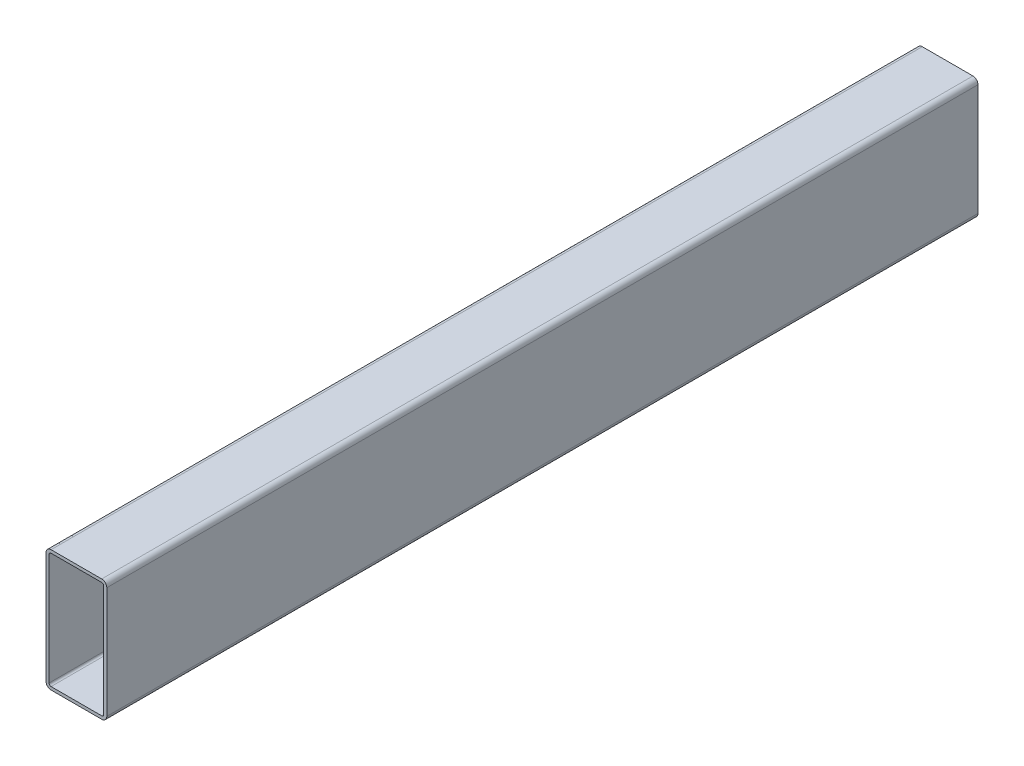
ISO-10303-21;
HEADER;
FILE_DESCRIPTION(('STEP AP214'),'2;1');
FILE_NAME('part.step','',(''),(''),'','','');
FILE_SCHEMA(('AUTOMOTIVE_DESIGN { 1 0 10303 214 1 1 1 1 }'));
ENDSEC;
DATA;
#1=APPLICATION_CONTEXT('core data for automotive mechanical design processes');
#2=APPLICATION_PROTOCOL_DEFINITION('international standard','automotive_design',2000,#1);
#3=PRODUCT_CONTEXT('',#1,'mechanical');
#4=PRODUCT('Part','Part','',(#3));
#5=PRODUCT_RELATED_PRODUCT_CATEGORY('part','',(#4));
#6=PRODUCT_DEFINITION_FORMATION('','',#4);
#7=PRODUCT_DEFINITION_CONTEXT('part definition',#1,'design');
#8=PRODUCT_DEFINITION('design','',#6,#7);
#9=PRODUCT_DEFINITION_SHAPE('','',#8);
#10=(LENGTH_UNIT() NAMED_UNIT(*) SI_UNIT(.MILLI.,.METRE.));
#11=(NAMED_UNIT(*) PLANE_ANGLE_UNIT() SI_UNIT($,.RADIAN.));
#12=(NAMED_UNIT(*) SI_UNIT($,.STERADIAN.) SOLID_ANGLE_UNIT());
#13=UNCERTAINTY_MEASURE_WITH_UNIT(LENGTH_MEASURE(1.E-05),#10,'distance_accuracy_value','');
#14=(GEOMETRIC_REPRESENTATION_CONTEXT(3) GLOBAL_UNCERTAINTY_ASSIGNED_CONTEXT((#13)) GLOBAL_UNIT_ASSIGNED_CONTEXT((#10,
#11,#12)) REPRESENTATION_CONTEXT('',''));
#15=CARTESIAN_POINT('',(0.,0.,0.));
#16=DIRECTION('',(0.,0.,1.));
#17=DIRECTION('',(1.,0.,0.));
#18=AXIS2_PLACEMENT_3D('',#15,#16,#17);
#19=CARTESIAN_POINT('',(-95.,-1299.,-564.164078649986));
#20=DIRECTION('',(0.,0.,1.));
#21=DIRECTION('',(1.,0.,0.));
#22=AXIS2_PLACEMENT_3D('',#19,#20,#21);
#23=CYLINDRICAL_SURFACE('',#22,2.);
#24=CARTESIAN_POINT('',(-95.,-1299.,-429.999999999999));
#25=DIRECTION('',(0.,0.,1.));
#26=DIRECTION('',(1.,0.,0.));
#27=AXIS2_PLACEMENT_3D('',#24,#25,#26);
#28=CIRCLE('',#27,2.);
#29=CARTESIAN_POINT('',(-93.,-1299.,-429.999999999999));
#30=VERTEX_POINT('',#29);
#31=CARTESIAN_POINT('',(-95.,-1297.,-429.999999999999));
#32=VERTEX_POINT('',#31);
#33=EDGE_CURVE('E150',#30,#32,#28,.T.);
#34=ORIENTED_EDGE('',*,*,#33,.F.);
#35=DIRECTION('',(0.,0.,1.));
#36=VECTOR('',#35,1.);
#37=CARTESIAN_POINT('',(-93.,-1299.,-564.164078649986));
#38=LINE('',#37,#36);
#39=CARTESIAN_POINT('',(-93.,-1299.,429.999999999999));
#40=VERTEX_POINT('',#39);
#41=EDGE_CURVE('E142',#40,#30,#38,.F.);
#42=ORIENTED_EDGE('',*,*,#41,.F.);
#43=CARTESIAN_POINT('',(-95.,-1299.,429.999999999999));
#44=DIRECTION('',(0.,0.,1.));
#45=DIRECTION('',(1.,0.,0.));
#46=AXIS2_PLACEMENT_3D('',#43,#44,#45);
#47=CIRCLE('',#46,2.);
#48=CARTESIAN_POINT('',(-95.,-1297.,429.999999999999));
#49=VERTEX_POINT('',#48);
#50=EDGE_CURVE('E204',#40,#49,#47,.T.);
#51=ORIENTED_EDGE('',*,*,#50,.T.);
#52=DIRECTION('',(0.,0.,-1.));
#53=VECTOR('',#52,1.);
#54=CARTESIAN_POINT('',(-95.,-1297.,-564.164078649986));
#55=LINE('',#54,#53);
#56=EDGE_CURVE('E178',#32,#49,#55,.F.);
#57=ORIENTED_EDGE('',*,*,#56,.F.);
#58=EDGE_LOOP('',(#34,#42,#51,#57));
#59=FACE_BOUND('',#58,.T.);
#60=ADVANCED_FACE('F17',(#59),#23,.F.);
#61=CARTESIAN_POINT('',(-150.,-1297.,-564.164078649986));
#62=DIRECTION('',(0.,-1.,0.));
#63=DIRECTION('',(0.,0.,-1.));
#64=AXIS2_PLACEMENT_3D('',#61,#62,#63);
#65=PLANE('',#64);
#66=ORIENTED_EDGE('',*,*,#56,.T.);
#67=DIRECTION('',(-1.,0.,0.));
#68=VECTOR('',#67,1.);
#69=CARTESIAN_POINT('',(1.73275416638304E-05,-1297.,429.999999999999));
#70=LINE('',#69,#68);
#71=CARTESIAN_POINT('',(-145.,-1297.,429.999999999999));
#72=VERTEX_POINT('',#71);
#73=EDGE_CURVE('E203',#49,#72,#70,.T.);
#74=ORIENTED_EDGE('',*,*,#73,.T.);
#75=DIRECTION('',(0.,0.,-1.));
#76=VECTOR('',#75,1.);
#77=CARTESIAN_POINT('',(-145.,-1297.,-564.164078649986));
#78=LINE('',#77,#76);
#79=CARTESIAN_POINT('',(-145.,-1297.,-429.999999999999));
#80=VERTEX_POINT('',#79);
#81=EDGE_CURVE('E176',#72,#80,#78,.T.);
#82=ORIENTED_EDGE('',*,*,#81,.T.);
#83=DIRECTION('',(-1.,0.,0.));
#84=VECTOR('',#83,1.);
#85=CARTESIAN_POINT('',(1.73275416638304E-05,-1297.,-429.999999999999));
#86=LINE('',#85,#84);
#87=EDGE_CURVE('E223',#32,#80,#86,.T.);
#88=ORIENTED_EDGE('',*,*,#87,.F.);
#89=EDGE_LOOP('',(#66,#74,#82,#88));
#90=FACE_BOUND('',#89,.T.);
#91=ADVANCED_FACE('F393',(#90),#65,.T.);
#92=CARTESIAN_POINT('',(-145.,-1299.,-564.164078649986));
#93=DIRECTION('',(0.,0.,-1.));
#94=DIRECTION('',(-1.,0.,0.));
#95=AXIS2_PLACEMENT_3D('',#92,#93,#94);
#96=CYLINDRICAL_SURFACE('',#95,2.);
#97=CARTESIAN_POINT('',(-145.,-1299.,-429.999999999999));
#98=DIRECTION('',(0.,0.,-1.));
#99=DIRECTION('',(-1.,0.,0.));
#100=AXIS2_PLACEMENT_3D('',#97,#98,#99);
#101=CIRCLE('',#100,2.);
#102=CARTESIAN_POINT('',(-147.,-1299.,-429.999999999999));
#103=VERTEX_POINT('',#102);
#104=EDGE_CURVE('E221',#80,#103,#101,.F.);
#105=ORIENTED_EDGE('',*,*,#104,.F.);
#106=ORIENTED_EDGE('',*,*,#81,.F.);
#107=CARTESIAN_POINT('',(-145.,-1299.,429.999999999999));
#108=DIRECTION('',(0.,0.,-1.));
#109=DIRECTION('',(-1.,0.,0.));
#110=AXIS2_PLACEMENT_3D('',#107,#108,#109);
#111=CIRCLE('',#110,2.);
#112=CARTESIAN_POINT('',(-147.,-1299.,429.999999999999));
#113=VERTEX_POINT('',#112);
#114=EDGE_CURVE('E201',#72,#113,#111,.F.);
#115=ORIENTED_EDGE('',*,*,#114,.T.);
#116=DIRECTION('',(0.,0.,1.));
#117=VECTOR('',#116,1.);
#118=CARTESIAN_POINT('',(-147.,-1299.,-564.164078649986));
#119=LINE('',#118,#117);
#120=EDGE_CURVE('E174',#113,#103,#119,.F.);
#121=ORIENTED_EDGE('',*,*,#120,.T.);
#122=EDGE_LOOP('',(#105,#106,#115,#121));
#123=FACE_BOUND('',#122,.T.);
#124=ADVANCED_FACE('F385',(#123),#96,.F.);
#125=CARTESIAN_POINT('',(-147.,-1294.,-564.164078649986));
#126=DIRECTION('',(-1.,0.,0.));
#127=DIRECTION('',(0.,-1.,0.));
#128=AXIS2_PLACEMENT_3D('',#125,#126,#127);
#129=PLANE('',#128);
#130=DIRECTION('',(0.,1.,0.));
#131=VECTOR('',#130,1.);
#132=CARTESIAN_POINT('',(-147.,-1429.,-429.999999999999));
#133=LINE('',#132,#131);
#134=CARTESIAN_POINT('',(-147.,-1409.,-429.999999999999));
#135=VERTEX_POINT('',#134);
#136=EDGE_CURVE('E220',#103,#135,#133,.F.);
#137=ORIENTED_EDGE('',*,*,#136,.F.);
#138=ORIENTED_EDGE('',*,*,#120,.F.);
#139=DIRECTION('',(0.,1.,0.));
#140=VECTOR('',#139,1.);
#141=CARTESIAN_POINT('',(-147.,-1429.,429.999999999999));
#142=LINE('',#141,#140);
#143=CARTESIAN_POINT('',(-147.,-1409.,429.999999999999));
#144=VERTEX_POINT('',#143);
#145=EDGE_CURVE('E200',#113,#144,#142,.F.);
#146=ORIENTED_EDGE('',*,*,#145,.T.);
#147=DIRECTION('',(0.,0.,1.));
#148=VECTOR('',#147,1.);
#149=CARTESIAN_POINT('',(-147.,-1409.,-564.164078649986));
#150=LINE('',#149,#148);
#151=EDGE_CURVE('E172',#144,#135,#150,.F.);
#152=ORIENTED_EDGE('',*,*,#151,.T.);
#153=EDGE_LOOP('',(#137,#138,#146,#152));
#154=FACE_BOUND('',#153,.T.);
#155=ADVANCED_FACE('F377',(#154),#129,.F.);
#156=CARTESIAN_POINT('',(-145.,-1409.,-564.164078649986));
#157=DIRECTION('',(0.,0.,1.));
#158=DIRECTION('',(1.,0.,0.));
#159=AXIS2_PLACEMENT_3D('',#156,#157,#158);
#160=CYLINDRICAL_SURFACE('',#159,2.);
#161=CARTESIAN_POINT('',(-145.,-1409.,-429.999999999999));
#162=DIRECTION('',(0.,0.,1.));
#163=DIRECTION('',(1.,0.,0.));
#164=AXIS2_PLACEMENT_3D('',#161,#162,#163);
#165=CIRCLE('',#164,2.);
#166=CARTESIAN_POINT('',(-145.,-1411.,-429.999999999999));
#167=VERTEX_POINT('',#166);
#168=EDGE_CURVE('E218',#135,#167,#165,.T.);
#169=ORIENTED_EDGE('',*,*,#168,.F.);
#170=ORIENTED_EDGE('',*,*,#151,.F.);
#171=CARTESIAN_POINT('',(-145.,-1409.,429.999999999999));
#172=DIRECTION('',(0.,0.,1.));
#173=DIRECTION('',(1.,0.,0.));
#174=AXIS2_PLACEMENT_3D('',#171,#172,#173);
#175=CIRCLE('',#174,2.);
#176=CARTESIAN_POINT('',(-145.,-1411.,429.999999999999));
#177=VERTEX_POINT('',#176);
#178=EDGE_CURVE('E198',#144,#177,#175,.T.);
#179=ORIENTED_EDGE('',*,*,#178,.T.);
#180=DIRECTION('',(0.,0.,-1.));
#181=VECTOR('',#180,1.);
#182=CARTESIAN_POINT('',(-145.,-1411.,-564.164078649986));
#183=LINE('',#182,#181);
#184=EDGE_CURVE('E170',#177,#167,#183,.T.);
#185=ORIENTED_EDGE('',*,*,#184,.T.);
#186=EDGE_LOOP('',(#169,#170,#179,#185));
#187=FACE_BOUND('',#186,.T.);
#188=ADVANCED_FACE('F370',(#187),#160,.F.);
#189=CARTESIAN_POINT('',(-150.,-1411.,-564.164078649986));
#190=DIRECTION('',(0.,-1.,0.));
#191=DIRECTION('',(0.,0.,-1.));
#192=AXIS2_PLACEMENT_3D('',#189,#190,#191);
#193=PLANE('',#192);
#194=DIRECTION('',(-1.,0.,0.));
#195=VECTOR('',#194,1.);
#196=CARTESIAN_POINT('',(1.73275416638304E-05,-1411.,429.999999999999));
#197=LINE('',#196,#195);
#198=CARTESIAN_POINT('',(-95.,-1411.,429.999999999999));
#199=VERTEX_POINT('',#198);
#200=EDGE_CURVE('E197',#177,#199,#197,.F.);
#201=ORIENTED_EDGE('',*,*,#200,.T.);
#202=DIRECTION('',(0.,0.,-1.));
#203=VECTOR('',#202,1.);
#204=CARTESIAN_POINT('',(-95.,-1411.,-564.164078649986));
#205=LINE('',#204,#203);
#206=CARTESIAN_POINT('',(-95.,-1411.,-429.999999999999));
#207=VERTEX_POINT('',#206);
#208=EDGE_CURVE('E127',#199,#207,#205,.T.);
#209=ORIENTED_EDGE('',*,*,#208,.T.);
#210=DIRECTION('',(-1.,0.,0.));
#211=VECTOR('',#210,1.);
#212=CARTESIAN_POINT('',(1.73275416638304E-05,-1411.,-429.999999999999));
#213=LINE('',#212,#211);
#214=EDGE_CURVE('E154',#167,#207,#213,.F.);
#215=ORIENTED_EDGE('',*,*,#214,.F.);
#216=ORIENTED_EDGE('',*,*,#184,.F.);
#217=EDGE_LOOP('',(#201,#209,#215,#216));
#218=FACE_BOUND('',#217,.T.);
#219=ADVANCED_FACE('F363',(#218),#193,.F.);
#220=CARTESIAN_POINT('',(-95.,-1409.,-564.164078649986));
#221=DIRECTION('',(0.,0.,-1.));
#222=DIRECTION('',(-1.,0.,0.));
#223=AXIS2_PLACEMENT_3D('',#220,#221,#222);
#224=CYLINDRICAL_SURFACE('',#223,2.);
#225=CARTESIAN_POINT('',(-95.,-1409.,-429.999999999999));
#226=DIRECTION('',(0.,0.,-1.));
#227=DIRECTION('',(-1.,0.,0.));
#228=AXIS2_PLACEMENT_3D('',#225,#226,#227);
#229=CIRCLE('',#228,2.);
#230=CARTESIAN_POINT('',(-93.,-1409.,-429.999999999999));
#231=VERTEX_POINT('',#230);
#232=EDGE_CURVE('E20',#207,#231,#229,.F.);
#233=ORIENTED_EDGE('',*,*,#232,.F.);
#234=ORIENTED_EDGE('',*,*,#208,.F.);
#235=CARTESIAN_POINT('',(-95.,-1409.,429.999999999999));
#236=DIRECTION('',(0.,0.,-1.));
#237=DIRECTION('',(-1.,0.,0.));
#238=AXIS2_PLACEMENT_3D('',#235,#236,#237);
#239=CIRCLE('',#238,2.);
#240=CARTESIAN_POINT('',(-93.,-1409.,429.999999999999));
#241=VERTEX_POINT('',#240);
#242=EDGE_CURVE('E138',#199,#241,#239,.F.);
#243=ORIENTED_EDGE('',*,*,#242,.T.);
#244=DIRECTION('',(0.,0.,1.));
#245=VECTOR('',#244,1.);
#246=CARTESIAN_POINT('',(-93.,-1409.,-564.164078649986));
#247=LINE('',#246,#245);
#248=EDGE_CURVE('E132',#231,#241,#247,.T.);
#249=ORIENTED_EDGE('',*,*,#248,.F.);
#250=EDGE_LOOP('',(#233,#234,#243,#249));
#251=FACE_BOUND('',#250,.T.);
#252=ADVANCED_FACE('F134',(#251),#224,.F.);
#253=CARTESIAN_POINT('',(-93.,-1294.,-564.164078649986));
#254=DIRECTION('',(-1.,0.,0.));
#255=DIRECTION('',(0.,-1.,0.));
#256=AXIS2_PLACEMENT_3D('',#253,#254,#255);
#257=PLANE('',#256);
#258=ORIENTED_EDGE('',*,*,#41,.T.);
#259=DIRECTION('',(0.,1.,0.));
#260=VECTOR('',#259,1.);
#261=CARTESIAN_POINT('',(-93.,-1429.,-429.999999999999));
#262=LINE('',#261,#260);
#263=EDGE_CURVE('E145',#231,#30,#262,.T.);
#264=ORIENTED_EDGE('',*,*,#263,.F.);
#265=ORIENTED_EDGE('',*,*,#248,.T.);
#266=DIRECTION('',(0.,1.,0.));
#267=VECTOR('',#266,1.);
#268=CARTESIAN_POINT('',(-93.,-1429.,429.999999999999));
#269=LINE('',#268,#267);
#270=EDGE_CURVE('E196',#241,#40,#269,.T.);
#271=ORIENTED_EDGE('',*,*,#270,.T.);
#272=EDGE_LOOP('',(#258,#264,#265,#271));
#273=FACE_BOUND('',#272,.T.);
#274=ADVANCED_FACE('F146',(#273),#257,.T.);
#275=CARTESIAN_POINT('',(-95.,-1299.,-564.164078649986));
#276=DIRECTION('',(0.,0.,1.));
#277=DIRECTION('',(1.,0.,0.));
#278=AXIS2_PLACEMENT_3D('',#275,#276,#277);
#279=CYLINDRICAL_SURFACE('',#278,5.);
#280=CARTESIAN_POINT('',(-95.,-1299.,429.999999999999));
#281=DIRECTION('',(0.,0.,1.));
#282=DIRECTION('',(1.,0.,0.));
#283=AXIS2_PLACEMENT_3D('',#280,#281,#282);
#284=CIRCLE('',#283,5.);
#285=CARTESIAN_POINT('',(-95.,-1294.,429.999999999999));
#286=VERTEX_POINT('',#285);
#287=CARTESIAN_POINT('',(-90.,-1299.,429.999999999999));
#288=VERTEX_POINT('',#287);
#289=EDGE_CURVE('E192',#286,#288,#284,.F.);
#290=ORIENTED_EDGE('',*,*,#289,.T.);
#291=DIRECTION('',(0.,0.,1.));
#292=VECTOR('',#291,1.);
#293=CARTESIAN_POINT('',(-90.,-1299.,-564.164078649986));
#294=LINE('',#293,#292);
#295=CARTESIAN_POINT('',(-90.,-1299.,-429.999999999999));
#296=VERTEX_POINT('',#295);
#297=EDGE_CURVE('E165',#288,#296,#294,.F.);
#298=ORIENTED_EDGE('',*,*,#297,.T.);
#299=CARTESIAN_POINT('',(-95.,-1299.,-429.999999999999));
#300=DIRECTION('',(0.,0.,1.));
#301=DIRECTION('',(1.,0.,0.));
#302=AXIS2_PLACEMENT_3D('',#299,#300,#301);
#303=CIRCLE('',#302,5.);
#304=CARTESIAN_POINT('',(-95.,-1294.,-429.999999999999));
#305=VERTEX_POINT('',#304);
#306=EDGE_CURVE('E214',#305,#296,#303,.F.);
#307=ORIENTED_EDGE('',*,*,#306,.F.);
#308=DIRECTION('',(0.,0.,-1.));
#309=VECTOR('',#308,1.);
#310=CARTESIAN_POINT('',(-95.,-1294.,-564.164078649986));
#311=LINE('',#310,#309);
#312=EDGE_CURVE('E155',#305,#286,#311,.F.);
#313=ORIENTED_EDGE('',*,*,#312,.T.);
#314=EDGE_LOOP('',(#290,#298,#307,#313));
#315=FACE_BOUND('',#314,.T.);
#316=ADVANCED_FACE('F240',(#315),#279,.T.);
#317=CARTESIAN_POINT('',(-90.,-1294.,-564.164078649986));
#318=DIRECTION('',(-1.,0.,0.));
#319=DIRECTION('',(0.,-1.,0.));
#320=AXIS2_PLACEMENT_3D('',#317,#318,#319);
#321=PLANE('',#320);
#322=DIRECTION('',(0.,0.,-1.));
#323=VECTOR('',#322,1.);
#324=CARTESIAN_POINT('',(-90.,-1409.,-564.164078649986));
#325=LINE('',#324,#323);
#326=CARTESIAN_POINT('',(-90.,-1409.,-429.999999999999));
#327=VERTEX_POINT('',#326);
#328=CARTESIAN_POINT('',(-90.,-1409.,429.999999999999));
#329=VERTEX_POINT('',#328);
#330=EDGE_CURVE('E162',#327,#329,#325,.F.);
#331=ORIENTED_EDGE('',*,*,#330,.F.);
#332=DIRECTION('',(0.,1.,0.));
#333=VECTOR('',#332,1.);
#334=CARTESIAN_POINT('',(-90.,-1429.,-429.999999999999));
#335=LINE('',#334,#333);
#336=EDGE_CURVE('E213',#296,#327,#335,.F.);
#337=ORIENTED_EDGE('',*,*,#336,.F.);
#338=ORIENTED_EDGE('',*,*,#297,.F.);
#339=DIRECTION('',(0.,1.,0.));
#340=VECTOR('',#339,1.);
#341=CARTESIAN_POINT('',(-90.,-1429.,429.999999999999));
#342=LINE('',#341,#340);
#343=EDGE_CURVE('E191',#288,#329,#342,.F.);
#344=ORIENTED_EDGE('',*,*,#343,.T.);
#345=EDGE_LOOP('',(#331,#337,#338,#344));
#346=FACE_BOUND('',#345,.T.);
#347=ADVANCED_FACE('F246',(#346),#321,.F.);
#348=CARTESIAN_POINT('',(-95.,-1409.,-564.164078649986));
#349=DIRECTION('',(0.,0.,-1.));
#350=DIRECTION('',(-1.,0.,0.));
#351=AXIS2_PLACEMENT_3D('',#348,#349,#350);
#352=CYLINDRICAL_SURFACE('',#351,5.);
#353=CARTESIAN_POINT('',(-95.,-1409.,429.999999999999));
#354=DIRECTION('',(0.,0.,-1.));
#355=DIRECTION('',(-1.,0.,0.));
#356=AXIS2_PLACEMENT_3D('',#353,#354,#355);
#357=CIRCLE('',#356,5.);
#358=CARTESIAN_POINT('',(-95.,-1414.,429.999999999999));
#359=VERTEX_POINT('',#358);
#360=EDGE_CURVE('E189',#329,#359,#357,.T.);
#361=ORIENTED_EDGE('',*,*,#360,.T.);
#362=DIRECTION('',(0.,0.,-1.));
#363=VECTOR('',#362,1.);
#364=CARTESIAN_POINT('',(-95.,-1414.,-564.164078649986));
#365=LINE('',#364,#363);
#366=CARTESIAN_POINT('',(-95.,-1414.,-429.999999999999));
#367=VERTEX_POINT('',#366);
#368=EDGE_CURVE('E156',#367,#359,#365,.F.);
#369=ORIENTED_EDGE('',*,*,#368,.F.);
#370=CARTESIAN_POINT('',(-95.,-1409.,-429.999999999999));
#371=DIRECTION('',(0.,0.,-1.));
#372=DIRECTION('',(-1.,0.,0.));
#373=AXIS2_PLACEMENT_3D('',#370,#371,#372);
#374=CIRCLE('',#373,5.);
#375=EDGE_CURVE('E210',#327,#367,#374,.T.);
#376=ORIENTED_EDGE('',*,*,#375,.F.);
#377=ORIENTED_EDGE('',*,*,#330,.T.);
#378=EDGE_LOOP('',(#361,#369,#376,#377));
#379=FACE_BOUND('',#378,.T.);
#380=ADVANCED_FACE('F285',(#379),#352,.T.);
#381=CARTESIAN_POINT('',(-150.,-1414.,-564.164078649986));
#382=DIRECTION('',(0.,-1.,0.));
#383=DIRECTION('',(0.,0.,-1.));
#384=AXIS2_PLACEMENT_3D('',#381,#382,#383);
#385=PLANE('',#384);
#386=DIRECTION('',(-1.,0.,0.));
#387=VECTOR('',#386,1.);
#388=CARTESIAN_POINT('',(1.73275416638304E-05,-1414.,-429.999999999999));
#389=LINE('',#388,#387);
#390=CARTESIAN_POINT('',(-145.,-1414.,-429.999999999999));
#391=VERTEX_POINT('',#390);
#392=EDGE_CURVE('E252',#367,#391,#389,.T.);
#393=ORIENTED_EDGE('',*,*,#392,.F.);
#394=ORIENTED_EDGE('',*,*,#368,.T.);
#395=DIRECTION('',(-1.,0.,0.));
#396=VECTOR('',#395,1.);
#397=CARTESIAN_POINT('',(1.73275416638304E-05,-1414.,429.999999999999));
#398=LINE('',#397,#396);
#399=CARTESIAN_POINT('',(-145.,-1414.,429.999999999999));
#400=VERTEX_POINT('',#399);
#401=EDGE_CURVE('E188',#359,#400,#398,.T.);
#402=ORIENTED_EDGE('',*,*,#401,.T.);
#403=DIRECTION('',(0.,0.,1.));
#404=VECTOR('',#403,1.);
#405=CARTESIAN_POINT('',(-145.,-1414.,-564.164078649986));
#406=LINE('',#405,#404);
#407=EDGE_CURVE('E206',#391,#400,#406,.T.);
#408=ORIENTED_EDGE('',*,*,#407,.F.);
#409=EDGE_LOOP('',(#393,#394,#402,#408));
#410=FACE_BOUND('',#409,.T.);
#411=ADVANCED_FACE('F273',(#410),#385,.T.);
#412=CARTESIAN_POINT('',(-150.,-1294.,-564.164078649986));
#413=DIRECTION('',(0.,-1.,0.));
#414=DIRECTION('',(0.,0.,-1.));
#415=AXIS2_PLACEMENT_3D('',#412,#413,#414);
#416=PLANE('',#415);
#417=DIRECTION('',(0.,0.,-1.));
#418=VECTOR('',#417,1.);
#419=CARTESIAN_POINT('',(-145.,-1294.,-564.164078649986));
#420=LINE('',#419,#418);
#421=CARTESIAN_POINT('',(-145.,-1294.,429.999999999999));
#422=VERTEX_POINT('',#421);
#423=CARTESIAN_POINT('',(-145.,-1294.,-429.999999999999));
#424=VERTEX_POINT('',#423);
#425=EDGE_CURVE('E182',#422,#424,#420,.T.);
#426=ORIENTED_EDGE('',*,*,#425,.F.);
#427=DIRECTION('',(-1.,0.,0.));
#428=VECTOR('',#427,1.);
#429=CARTESIAN_POINT('',(1.73275416638304E-05,-1294.,429.999999999999));
#430=LINE('',#429,#428);
#431=EDGE_CURVE('E194',#422,#286,#430,.F.);
#432=ORIENTED_EDGE('',*,*,#431,.T.);
#433=ORIENTED_EDGE('',*,*,#312,.F.);
#434=DIRECTION('',(-1.,0.,0.));
#435=VECTOR('',#434,1.);
#436=CARTESIAN_POINT('',(1.73275416638304E-05,-1294.,-429.999999999999));
#437=LINE('',#436,#435);
#438=EDGE_CURVE('E217',#424,#305,#437,.F.);
#439=ORIENTED_EDGE('',*,*,#438,.F.);
#440=EDGE_LOOP('',(#426,#432,#433,#439));
#441=FACE_BOUND('',#440,.T.);
#442=ADVANCED_FACE('F284',(#441),#416,.F.);
#443=CARTESIAN_POINT('',(1.73275416638304E-05,-1429.,-429.999999999999));
#444=DIRECTION('',(0.,0.,-1.));
#445=DIRECTION('',(-1.,0.,0.));
#446=AXIS2_PLACEMENT_3D('',#443,#444,#445);
#447=PLANE('',#446);
#448=ORIENTED_EDGE('',*,*,#336,.T.);
#449=ORIENTED_EDGE('',*,*,#375,.T.);
#450=ORIENTED_EDGE('',*,*,#392,.T.);
#451=CARTESIAN_POINT('',(-145.,-1409.,-429.999999999999));
#452=DIRECTION('',(0.,0.,1.));
#453=DIRECTION('',(1.,0.,0.));
#454=AXIS2_PLACEMENT_3D('',#451,#452,#453);
#455=CIRCLE('',#454,5.);
#456=CARTESIAN_POINT('',(-150.,-1409.,-429.999999999999));
#457=VERTEX_POINT('',#456);
#458=EDGE_CURVE('E207',#457,#391,#455,.T.);
#459=ORIENTED_EDGE('',*,*,#458,.F.);
#460=DIRECTION('',(0.,-1.,0.));
#461=VECTOR('',#460,1.);
#462=CARTESIAN_POINT('',(-150.,-1294.,-429.999999999999));
#463=LINE('',#462,#461);
#464=CARTESIAN_POINT('',(-150.,-1299.,-429.999999999999));
#465=VERTEX_POINT('',#464);
#466=EDGE_CURVE('E232',#465,#457,#463,.T.);
#467=ORIENTED_EDGE('',*,*,#466,.F.);
#468=CARTESIAN_POINT('',(-145.,-1299.,-429.999999999999));
#469=DIRECTION('',(0.,0.,-1.));
#470=DIRECTION('',(-1.,0.,0.));
#471=AXIS2_PLACEMENT_3D('',#468,#469,#470);
#472=CIRCLE('',#471,5.);
#473=EDGE_CURVE('E183',#424,#465,#472,.F.);
#474=ORIENTED_EDGE('',*,*,#473,.F.);
#475=ORIENTED_EDGE('',*,*,#438,.T.);
#476=ORIENTED_EDGE('',*,*,#306,.T.);
#477=EDGE_LOOP('',(#448,#449,#450,#459,#467,#474,#475,#476));
#478=FACE_BOUND('',#477,.T.);
#479=ORIENTED_EDGE('',*,*,#168,.T.);
#480=ORIENTED_EDGE('',*,*,#214,.T.);
#481=ORIENTED_EDGE('',*,*,#232,.T.);
#482=ORIENTED_EDGE('',*,*,#263,.T.);
#483=ORIENTED_EDGE('',*,*,#33,.T.);
#484=ORIENTED_EDGE('',*,*,#87,.T.);
#485=ORIENTED_EDGE('',*,*,#104,.T.);
#486=ORIENTED_EDGE('',*,*,#136,.T.);
#487=EDGE_LOOP('',(#479,#480,#481,#482,#483,#484,#485,#486));
#488=FACE_BOUND('',#487,.T.);
#489=ADVANCED_FACE('F153',(#478,#488),#447,.T.);
#490=CARTESIAN_POINT('',(-145.,-1409.,-564.164078649986));
#491=DIRECTION('',(0.,0.,1.));
#492=DIRECTION('',(1.,0.,0.));
#493=AXIS2_PLACEMENT_3D('',#490,#491,#492);
#494=CYLINDRICAL_SURFACE('',#493,5.);
#495=CARTESIAN_POINT('',(-145.,-1409.,429.999999999999));
#496=DIRECTION('',(0.,0.,1.));
#497=DIRECTION('',(1.,0.,0.));
#498=AXIS2_PLACEMENT_3D('',#495,#496,#497);
#499=CIRCLE('',#498,5.);
#500=CARTESIAN_POINT('',(-150.,-1409.,429.999999999999));
#501=VERTEX_POINT('',#500);
#502=EDGE_CURVE('E186',#400,#501,#499,.F.);
#503=ORIENTED_EDGE('',*,*,#502,.T.);
#504=DIRECTION('',(0.,0.,1.));
#505=VECTOR('',#504,1.);
#506=CARTESIAN_POINT('',(-150.,-1409.,-564.164078649986));
#507=LINE('',#506,#505);
#508=EDGE_CURVE('E257',#457,#501,#507,.T.);
#509=ORIENTED_EDGE('',*,*,#508,.F.);
#510=ORIENTED_EDGE('',*,*,#458,.T.);
#511=ORIENTED_EDGE('',*,*,#407,.T.);
#512=EDGE_LOOP('',(#503,#509,#510,#511));
#513=FACE_BOUND('',#512,.T.);
#514=ADVANCED_FACE('F276',(#513),#494,.T.);
#515=CARTESIAN_POINT('',(1.73275416638304E-05,-1429.,429.999999999999));
#516=DIRECTION('',(0.,0.,-1.));
#517=DIRECTION('',(-1.,0.,0.));
#518=AXIS2_PLACEMENT_3D('',#515,#516,#517);
#519=PLANE('',#518);
#520=ORIENTED_EDGE('',*,*,#502,.F.);
#521=ORIENTED_EDGE('',*,*,#401,.F.);
#522=ORIENTED_EDGE('',*,*,#360,.F.);
#523=ORIENTED_EDGE('',*,*,#343,.F.);
#524=ORIENTED_EDGE('',*,*,#289,.F.);
#525=ORIENTED_EDGE('',*,*,#431,.F.);
#526=CARTESIAN_POINT('',(-145.,-1299.,429.999999999999));
#527=DIRECTION('',(0.,0.,-1.));
#528=DIRECTION('',(-1.,0.,0.));
#529=AXIS2_PLACEMENT_3D('',#526,#527,#528);
#530=CIRCLE('',#529,5.);
#531=CARTESIAN_POINT('',(-150.,-1299.,429.999999999999));
#532=VERTEX_POINT('',#531);
#533=EDGE_CURVE('E35',#532,#422,#530,.T.);
#534=ORIENTED_EDGE('',*,*,#533,.F.);
#535=DIRECTION('',(0.,-1.,0.));
#536=VECTOR('',#535,1.);
#537=CARTESIAN_POINT('',(-150.,-1294.,429.999999999999));
#538=LINE('',#537,#536);
#539=EDGE_CURVE('E26',#501,#532,#538,.F.);
#540=ORIENTED_EDGE('',*,*,#539,.F.);
#541=EDGE_LOOP('',(#520,#521,#522,#523,#524,#525,#534,#540));
#542=FACE_BOUND('',#541,.T.);
#543=ORIENTED_EDGE('',*,*,#242,.F.);
#544=ORIENTED_EDGE('',*,*,#200,.F.);
#545=ORIENTED_EDGE('',*,*,#178,.F.);
#546=ORIENTED_EDGE('',*,*,#145,.F.);
#547=ORIENTED_EDGE('',*,*,#114,.F.);
#548=ORIENTED_EDGE('',*,*,#73,.F.);
#549=ORIENTED_EDGE('',*,*,#50,.F.);
#550=ORIENTED_EDGE('',*,*,#270,.F.);
#551=EDGE_LOOP('',(#543,#544,#545,#546,#547,#548,#549,#550));
#552=FACE_BOUND('',#551,.T.);
#553=ADVANCED_FACE('F278',(#542,#552),#519,.F.);
#554=CARTESIAN_POINT('',(-145.,-1299.,-564.164078649986));
#555=DIRECTION('',(0.,0.,-1.));
#556=DIRECTION('',(-1.,0.,0.));
#557=AXIS2_PLACEMENT_3D('',#554,#555,#556);
#558=CYLINDRICAL_SURFACE('',#557,5.);
#559=ORIENTED_EDGE('',*,*,#533,.T.);
#560=ORIENTED_EDGE('',*,*,#425,.T.);
#561=ORIENTED_EDGE('',*,*,#473,.T.);
#562=DIRECTION('',(0.,0.,1.));
#563=VECTOR('',#562,1.);
#564=CARTESIAN_POINT('',(-150.,-1299.,-564.164078649986));
#565=LINE('',#564,#563);
#566=EDGE_CURVE('E11',#532,#465,#565,.F.);
#567=ORIENTED_EDGE('',*,*,#566,.F.);
#568=EDGE_LOOP('',(#559,#560,#561,#567));
#569=FACE_BOUND('',#568,.T.);
#570=ADVANCED_FACE('F283',(#569),#558,.T.);
#571=CARTESIAN_POINT('',(-150.,-1294.,-564.164078649986));
#572=DIRECTION('',(-1.,0.,0.));
#573=DIRECTION('',(0.,-1.,0.));
#574=AXIS2_PLACEMENT_3D('',#571,#572,#573);
#575=PLANE('',#574);
#576=ORIENTED_EDGE('',*,*,#539,.T.);
#577=ORIENTED_EDGE('',*,*,#566,.T.);
#578=ORIENTED_EDGE('',*,*,#466,.T.);
#579=ORIENTED_EDGE('',*,*,#508,.T.);
#580=EDGE_LOOP('',(#576,#577,#578,#579));
#581=FACE_BOUND('',#580,.T.);
#582=ADVANCED_FACE('F281',(#581),#575,.T.);
#583=CLOSED_SHELL('',(#60,#91,#124,#155,#188,#219,#252,#274,#316,#347,#380,#411,#442,#489,#514,
#553,#570,#582));
#584=MANIFOLD_SOLID_BREP('B1',#583);
#585=ADVANCED_BREP_SHAPE_REPRESENTATION('',(#18,#584),#14);
#586=SHAPE_DEFINITION_REPRESENTATION(#9,#585);
ENDSEC;
END-ISO-10303-21;
